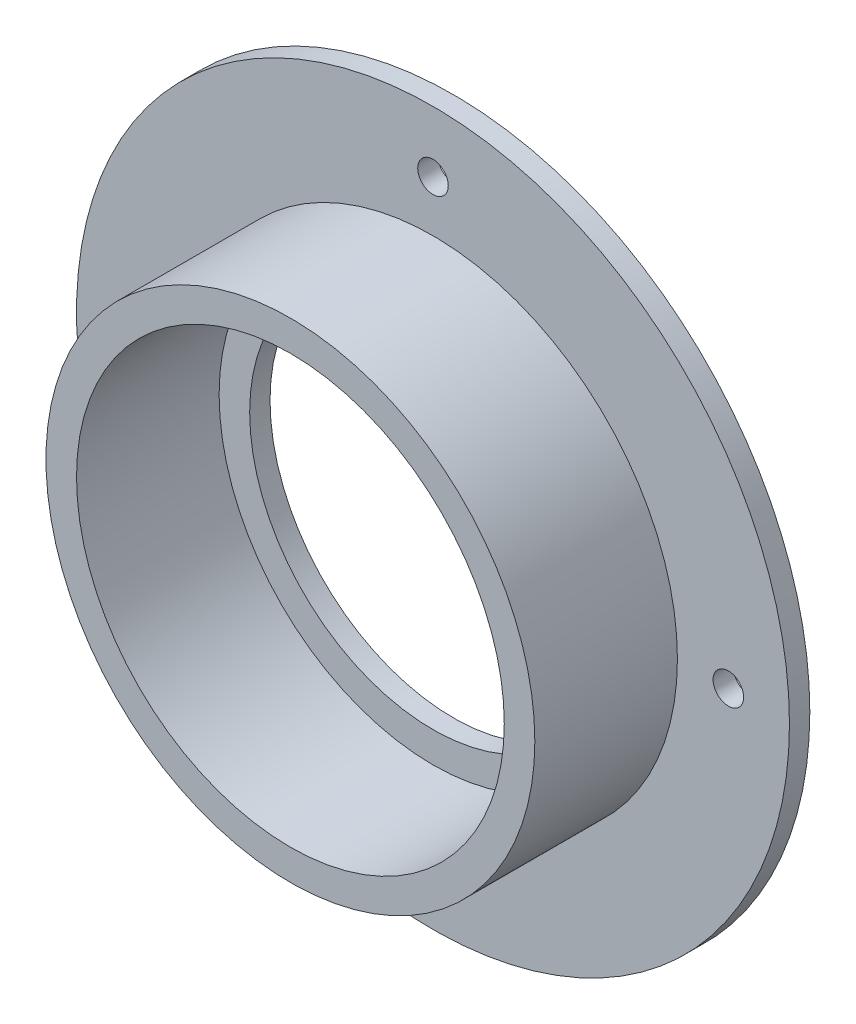
ISO-10303-21;
HEADER;
FILE_DESCRIPTION(('STEP AP214'),'2;1');
FILE_NAME('part.step','',(''),(''),'','','');
FILE_SCHEMA(('AUTOMOTIVE_DESIGN { 1 0 10303 214 1 1 1 1 }'));
ENDSEC;
DATA;
#1=APPLICATION_CONTEXT('core data for automotive mechanical design processes');
#2=APPLICATION_PROTOCOL_DEFINITION('international standard','automotive_design',2000,#1);
#3=PRODUCT_CONTEXT('',#1,'mechanical');
#4=PRODUCT('Part','Part','',(#3));
#5=PRODUCT_RELATED_PRODUCT_CATEGORY('part','',(#4));
#6=PRODUCT_DEFINITION_FORMATION('','',#4);
#7=PRODUCT_DEFINITION_CONTEXT('part definition',#1,'design');
#8=PRODUCT_DEFINITION('design','',#6,#7);
#9=PRODUCT_DEFINITION_SHAPE('','',#8);
#10=(LENGTH_UNIT() NAMED_UNIT(*) SI_UNIT(.MILLI.,.METRE.));
#11=(NAMED_UNIT(*) PLANE_ANGLE_UNIT() SI_UNIT($,.RADIAN.));
#12=(NAMED_UNIT(*) SI_UNIT($,.STERADIAN.) SOLID_ANGLE_UNIT());
#13=UNCERTAINTY_MEASURE_WITH_UNIT(LENGTH_MEASURE(1.E-05),#10,'distance_accuracy_value','');
#14=(GEOMETRIC_REPRESENTATION_CONTEXT(3) GLOBAL_UNCERTAINTY_ASSIGNED_CONTEXT((#13)) GLOBAL_UNIT_ASSIGNED_CONTEXT((#10,
#11,#12)) REPRESENTATION_CONTEXT('',''));
#15=CARTESIAN_POINT('',(0.,0.,0.));
#16=DIRECTION('',(0.,0.,1.));
#17=DIRECTION('',(1.,0.,0.));
#18=AXIS2_PLACEMENT_3D('',#15,#16,#17);
#19=CARTESIAN_POINT('',(0.,0.,16.));
#20=DIRECTION('',(0.,0.,-1.));
#21=DIRECTION('',(-1.,0.,0.));
#22=AXIS2_PLACEMENT_3D('',#19,#20,#21);
#23=CYLINDRICAL_SURFACE('',#22,21.);
#24=CARTESIAN_POINT('',(0.,0.,16.));
#25=DIRECTION('',(0.,0.,1.));
#26=DIRECTION('',(1.,0.,0.));
#27=AXIS2_PLACEMENT_3D('',#24,#25,#26);
#28=CIRCLE('',#27,21.);
#29=CARTESIAN_POINT('',(21.,0.,16.));
#30=VERTEX_POINT('',#29);
#31=EDGE_CURVE('E56',#30,#30,#28,.T.);
#32=ORIENTED_EDGE('',*,*,#31,.T.);
#33=EDGE_LOOP('',(#32));
#34=FACE_BOUND('',#33,.T.);
#35=CARTESIAN_POINT('',(0.,0.,2.));
#36=DIRECTION('',(0.,0.,-1.));
#37=DIRECTION('',(-1.,0.,0.));
#38=AXIS2_PLACEMENT_3D('',#35,#36,#37);
#39=CIRCLE('',#38,21.);
#40=CARTESIAN_POINT('',(-21.,0.,2.));
#41=VERTEX_POINT('',#40);
#42=EDGE_CURVE('E69',#41,#41,#39,.T.);
#43=ORIENTED_EDGE('',*,*,#42,.T.);
#44=EDGE_LOOP('',(#43));
#45=FACE_BOUND('',#44,.T.);
#46=ADVANCED_FACE('F37',(#34,#45),#23,.F.);
#47=CARTESIAN_POINT('',(0.,0.,2.));
#48=DIRECTION('',(0.,0.,-1.));
#49=DIRECTION('',(-1.,0.,0.));
#50=AXIS2_PLACEMENT_3D('',#47,#48,#49);
#51=CYLINDRICAL_SURFACE('',#50,35.);
#52=CARTESIAN_POINT('',(0.,0.,2.));
#53=DIRECTION('',(0.,0.,1.));
#54=DIRECTION('',(1.,0.,0.));
#55=AXIS2_PLACEMENT_3D('',#52,#53,#54);
#56=CIRCLE('',#55,35.);
#57=CARTESIAN_POINT('',(35.,0.,2.));
#58=VERTEX_POINT('',#57);
#59=EDGE_CURVE('E10',#58,#58,#56,.T.);
#60=ORIENTED_EDGE('',*,*,#59,.F.);
#61=EDGE_LOOP('',(#60));
#62=FACE_BOUND('',#61,.T.);
#63=CARTESIAN_POINT('',(0.,0.,0.));
#64=DIRECTION('',(0.,0.,1.));
#65=DIRECTION('',(1.,0.,0.));
#66=AXIS2_PLACEMENT_3D('',#63,#64,#65);
#67=CIRCLE('',#66,35.);
#68=CARTESIAN_POINT('',(35.,0.,0.));
#69=VERTEX_POINT('',#68);
#70=EDGE_CURVE('E41',#69,#69,#67,.T.);
#71=ORIENTED_EDGE('',*,*,#70,.T.);
#72=EDGE_LOOP('',(#71));
#73=FACE_BOUND('',#72,.T.);
#74=ADVANCED_FACE('F39',(#62,#73),#51,.T.);
#75=CARTESIAN_POINT('',(0.,0.,2.));
#76=DIRECTION('',(0.,0.,1.));
#77=DIRECTION('',(1.,0.,0.));
#78=AXIS2_PLACEMENT_3D('',#75,#76,#77);
#79=PLANE('',#78);
#80=CARTESIAN_POINT('',(-29.,0.,2.));
#81=DIRECTION('',(0.,0.,1.));
#82=DIRECTION('',(1.,0.,0.));
#83=AXIS2_PLACEMENT_3D('',#80,#81,#82);
#84=CIRCLE('',#83,1.5);
#85=CARTESIAN_POINT('',(-27.5,0.,2.));
#86=VERTEX_POINT('',#85);
#87=EDGE_CURVE('E89',#86,#86,#84,.F.);
#88=ORIENTED_EDGE('',*,*,#87,.T.);
#89=EDGE_LOOP('',(#88));
#90=FACE_BOUND('',#89,.T.);
#91=CARTESIAN_POINT('',(0.,-29.,2.));
#92=DIRECTION('',(0.,0.,1.));
#93=DIRECTION('',(1.,0.,0.));
#94=AXIS2_PLACEMENT_3D('',#91,#92,#93);
#95=CIRCLE('',#94,1.5);
#96=CARTESIAN_POINT('',(1.5,-29.,2.));
#97=VERTEX_POINT('',#96);
#98=EDGE_CURVE('E81',#97,#97,#95,.F.);
#99=ORIENTED_EDGE('',*,*,#98,.T.);
#100=EDGE_LOOP('',(#99));
#101=FACE_BOUND('',#100,.T.);
#102=CARTESIAN_POINT('',(29.,0.,2.));
#103=DIRECTION('',(0.,0.,1.));
#104=DIRECTION('',(1.,0.,0.));
#105=AXIS2_PLACEMENT_3D('',#102,#103,#104);
#106=CIRCLE('',#105,1.5);
#107=CARTESIAN_POINT('',(30.5,0.,2.));
#108=VERTEX_POINT('',#107);
#109=EDGE_CURVE('E73',#108,#108,#106,.F.);
#110=ORIENTED_EDGE('',*,*,#109,.T.);
#111=EDGE_LOOP('',(#110));
#112=FACE_BOUND('',#111,.T.);
#113=CARTESIAN_POINT('',(0.,29.,2.));
#114=DIRECTION('',(0.,0.,1.));
#115=DIRECTION('',(1.,0.,0.));
#116=AXIS2_PLACEMENT_3D('',#113,#114,#115);
#117=CIRCLE('',#116,1.5);
#118=CARTESIAN_POINT('',(1.5,29.,2.));
#119=VERTEX_POINT('',#118);
#120=EDGE_CURVE('E64',#119,#119,#117,.F.);
#121=ORIENTED_EDGE('',*,*,#120,.T.);
#122=EDGE_LOOP('',(#121));
#123=FACE_BOUND('',#122,.T.);
#124=CARTESIAN_POINT('',(0.,0.,2.));
#125=DIRECTION('',(0.,0.,1.));
#126=DIRECTION('',(1.,0.,0.));
#127=AXIS2_PLACEMENT_3D('',#124,#125,#126);
#128=CIRCLE('',#127,24.);
#129=CARTESIAN_POINT('',(24.,0.,2.));
#130=VERTEX_POINT('',#129);
#131=EDGE_CURVE('E52',#130,#130,#128,.T.);
#132=ORIENTED_EDGE('',*,*,#131,.F.);
#133=EDGE_LOOP('',(#132));
#134=FACE_BOUND('',#133,.T.);
#135=ORIENTED_EDGE('',*,*,#59,.T.);
#136=EDGE_LOOP('',(#135));
#137=FACE_BOUND('',#136,.T.);
#138=ADVANCED_FACE('F120',(#90,#101,#112,#123,#134,#137),#79,.T.);
#139=CARTESIAN_POINT('',(0.,0.,0.));
#140=DIRECTION('',(0.,0.,1.));
#141=DIRECTION('',(1.,0.,0.));
#142=AXIS2_PLACEMENT_3D('',#139,#140,#141);
#143=PLANE('',#142);
#144=CARTESIAN_POINT('',(-29.,0.,0.));
#145=DIRECTION('',(0.,0.,-1.));
#146=DIRECTION('',(-1.,0.,0.));
#147=AXIS2_PLACEMENT_3D('',#144,#145,#146);
#148=CIRCLE('',#147,1.5);
#149=CARTESIAN_POINT('',(-30.5,0.,0.));
#150=VERTEX_POINT('',#149);
#151=EDGE_CURVE('E63',#150,#150,#148,.T.);
#152=ORIENTED_EDGE('',*,*,#151,.F.);
#153=EDGE_LOOP('',(#152));
#154=FACE_BOUND('',#153,.T.);
#155=CARTESIAN_POINT('',(0.,-29.,0.));
#156=DIRECTION('',(0.,0.,-1.));
#157=DIRECTION('',(-1.,0.,0.));
#158=AXIS2_PLACEMENT_3D('',#155,#156,#157);
#159=CIRCLE('',#158,1.5);
#160=CARTESIAN_POINT('',(-1.5,-29.,0.));
#161=VERTEX_POINT('',#160);
#162=EDGE_CURVE('E85',#161,#161,#159,.T.);
#163=ORIENTED_EDGE('',*,*,#162,.F.);
#164=EDGE_LOOP('',(#163));
#165=FACE_BOUND('',#164,.T.);
#166=CARTESIAN_POINT('',(29.,0.,0.));
#167=DIRECTION('',(0.,0.,-1.));
#168=DIRECTION('',(-1.,0.,0.));
#169=AXIS2_PLACEMENT_3D('',#166,#167,#168);
#170=CIRCLE('',#169,1.5);
#171=CARTESIAN_POINT('',(27.5,0.,0.));
#172=VERTEX_POINT('',#171);
#173=EDGE_CURVE('E77',#172,#172,#170,.T.);
#174=ORIENTED_EDGE('',*,*,#173,.F.);
#175=EDGE_LOOP('',(#174));
#176=FACE_BOUND('',#175,.T.);
#177=CARTESIAN_POINT('',(0.,29.,0.));
#178=DIRECTION('',(0.,0.,-1.));
#179=DIRECTION('',(-1.,0.,0.));
#180=AXIS2_PLACEMENT_3D('',#177,#178,#179);
#181=CIRCLE('',#180,1.5);
#182=CARTESIAN_POINT('',(-1.5,29.,0.));
#183=VERTEX_POINT('',#182);
#184=EDGE_CURVE('E68',#183,#183,#181,.T.);
#185=ORIENTED_EDGE('',*,*,#184,.F.);
#186=EDGE_LOOP('',(#185));
#187=FACE_BOUND('',#186,.T.);
#188=ORIENTED_EDGE('',*,*,#70,.F.);
#189=EDGE_LOOP('',(#188));
#190=FACE_BOUND('',#189,.T.);
#191=CARTESIAN_POINT('',(0.,0.,0.));
#192=DIRECTION('',(0.,0.,-1.));
#193=DIRECTION('',(-1.,0.,0.));
#194=AXIS2_PLACEMENT_3D('',#191,#192,#193);
#195=CIRCLE('',#194,18.);
#196=CARTESIAN_POINT('',(-18.,0.,0.));
#197=VERTEX_POINT('',#196);
#198=EDGE_CURVE('E100',#197,#197,#195,.T.);
#199=ORIENTED_EDGE('',*,*,#198,.F.);
#200=EDGE_LOOP('',(#199));
#201=FACE_BOUND('',#200,.T.);
#202=ADVANCED_FACE('F117',(#154,#165,#176,#187,#190,#201),#143,.F.);
#203=CARTESIAN_POINT('',(0.,0.,16.));
#204=DIRECTION('',(0.,0.,1.));
#205=DIRECTION('',(1.,0.,0.));
#206=AXIS2_PLACEMENT_3D('',#203,#204,#205);
#207=PLANE('',#206);
#208=CARTESIAN_POINT('',(0.,0.,16.));
#209=DIRECTION('',(0.,0.,1.));
#210=DIRECTION('',(1.,0.,0.));
#211=AXIS2_PLACEMENT_3D('',#208,#209,#210);
#212=CIRCLE('',#211,24.);
#213=CARTESIAN_POINT('',(24.,0.,16.));
#214=VERTEX_POINT('',#213);
#215=EDGE_CURVE('E50',#214,#214,#212,.T.);
#216=ORIENTED_EDGE('',*,*,#215,.T.);
#217=EDGE_LOOP('',(#216));
#218=FACE_BOUND('',#217,.T.);
#219=ORIENTED_EDGE('',*,*,#31,.F.);
#220=EDGE_LOOP('',(#219));
#221=FACE_BOUND('',#220,.T.);
#222=ADVANCED_FACE('F119',(#218,#221),#207,.T.);
#223=CARTESIAN_POINT('',(0.,0.,16.));
#224=DIRECTION('',(0.,0.,-1.));
#225=DIRECTION('',(-1.,0.,0.));
#226=AXIS2_PLACEMENT_3D('',#223,#224,#225);
#227=CYLINDRICAL_SURFACE('',#226,24.);
#228=ORIENTED_EDGE('',*,*,#215,.F.);
#229=EDGE_LOOP('',(#228));
#230=FACE_BOUND('',#229,.T.);
#231=ORIENTED_EDGE('',*,*,#131,.T.);
#232=EDGE_LOOP('',(#231));
#233=FACE_BOUND('',#232,.T.);
#234=ADVANCED_FACE('F126',(#230,#233),#227,.T.);
#235=CARTESIAN_POINT('',(0.,29.,16.001));
#236=DIRECTION('',(0.,0.,-1.));
#237=DIRECTION('',(-1.,0.,0.));
#238=AXIS2_PLACEMENT_3D('',#235,#236,#237);
#239=CYLINDRICAL_SURFACE('',#238,1.5);
#240=ORIENTED_EDGE('',*,*,#120,.F.);
#241=EDGE_LOOP('',(#240));
#242=FACE_BOUND('',#241,.T.);
#243=ORIENTED_EDGE('',*,*,#184,.T.);
#244=EDGE_LOOP('',(#243));
#245=FACE_BOUND('',#244,.T.);
#246=ADVANCED_FACE('F142',(#242,#245),#239,.F.);
#247=CARTESIAN_POINT('',(29.,0.,16.001));
#248=DIRECTION('',(0.,0.,-1.));
#249=DIRECTION('',(-1.,0.,0.));
#250=AXIS2_PLACEMENT_3D('',#247,#248,#249);
#251=CYLINDRICAL_SURFACE('',#250,1.5);
#252=ORIENTED_EDGE('',*,*,#109,.F.);
#253=EDGE_LOOP('',(#252));
#254=FACE_BOUND('',#253,.T.);
#255=ORIENTED_EDGE('',*,*,#173,.T.);
#256=EDGE_LOOP('',(#255));
#257=FACE_BOUND('',#256,.T.);
#258=ADVANCED_FACE('F150',(#254,#257),#251,.F.);
#259=CARTESIAN_POINT('',(0.,-29.,16.001));
#260=DIRECTION('',(0.,0.,-1.));
#261=DIRECTION('',(-1.,0.,0.));
#262=AXIS2_PLACEMENT_3D('',#259,#260,#261);
#263=CYLINDRICAL_SURFACE('',#262,1.5);
#264=ORIENTED_EDGE('',*,*,#98,.F.);
#265=EDGE_LOOP('',(#264));
#266=FACE_BOUND('',#265,.T.);
#267=ORIENTED_EDGE('',*,*,#162,.T.);
#268=EDGE_LOOP('',(#267));
#269=FACE_BOUND('',#268,.T.);
#270=ADVANCED_FACE('F161',(#266,#269),#263,.F.);
#271=CARTESIAN_POINT('',(-29.,0.,16.001));
#272=DIRECTION('',(0.,0.,-1.));
#273=DIRECTION('',(-1.,0.,0.));
#274=AXIS2_PLACEMENT_3D('',#271,#272,#273);
#275=CYLINDRICAL_SURFACE('',#274,1.5);
#276=ORIENTED_EDGE('',*,*,#87,.F.);
#277=EDGE_LOOP('',(#276));
#278=FACE_BOUND('',#277,.T.);
#279=ORIENTED_EDGE('',*,*,#151,.T.);
#280=EDGE_LOOP('',(#279));
#281=FACE_BOUND('',#280,.T.);
#282=ADVANCED_FACE('F174',(#278,#281),#275,.F.);
#283=CARTESIAN_POINT('',(0.,0.,2.));
#284=DIRECTION('',(0.,0.,-1.));
#285=DIRECTION('',(-1.,0.,0.));
#286=AXIS2_PLACEMENT_3D('',#283,#284,#285);
#287=PLANE('',#286);
#288=CARTESIAN_POINT('',(0.,0.,2.));
#289=DIRECTION('',(0.,0.,-1.));
#290=DIRECTION('',(-1.,0.,0.));
#291=AXIS2_PLACEMENT_3D('',#288,#289,#290);
#292=CIRCLE('',#291,18.);
#293=CARTESIAN_POINT('',(-18.,0.,2.));
#294=VERTEX_POINT('',#293);
#295=EDGE_CURVE('E99',#294,#294,#292,.T.);
#296=ORIENTED_EDGE('',*,*,#295,.T.);
#297=EDGE_LOOP('',(#296));
#298=FACE_BOUND('',#297,.T.);
#299=ORIENTED_EDGE('',*,*,#42,.F.);
#300=EDGE_LOOP('',(#299));
#301=FACE_BOUND('',#300,.T.);
#302=ADVANCED_FACE('F108',(#298,#301),#287,.F.);
#303=CARTESIAN_POINT('',(0.,0.,2.));
#304=DIRECTION('',(0.,0.,-1.));
#305=DIRECTION('',(-1.,0.,0.));
#306=AXIS2_PLACEMENT_3D('',#303,#304,#305);
#307=CYLINDRICAL_SURFACE('',#306,18.);
#308=ORIENTED_EDGE('',*,*,#295,.F.);
#309=EDGE_LOOP('',(#308));
#310=FACE_BOUND('',#309,.T.);
#311=ORIENTED_EDGE('',*,*,#198,.T.);
#312=EDGE_LOOP('',(#311));
#313=FACE_BOUND('',#312,.T.);
#314=ADVANCED_FACE('F111',(#310,#313),#307,.F.);
#315=CLOSED_SHELL('',(#46,#74,#138,#202,#222,#234,#246,#258,#270,#282,#302,#314));
#316=MANIFOLD_SOLID_BREP('B2',#315);
#317=ADVANCED_BREP_SHAPE_REPRESENTATION('',(#18,#316),#14);
#318=SHAPE_DEFINITION_REPRESENTATION(#9,#317);
ENDSEC;
END-ISO-10303-21;
